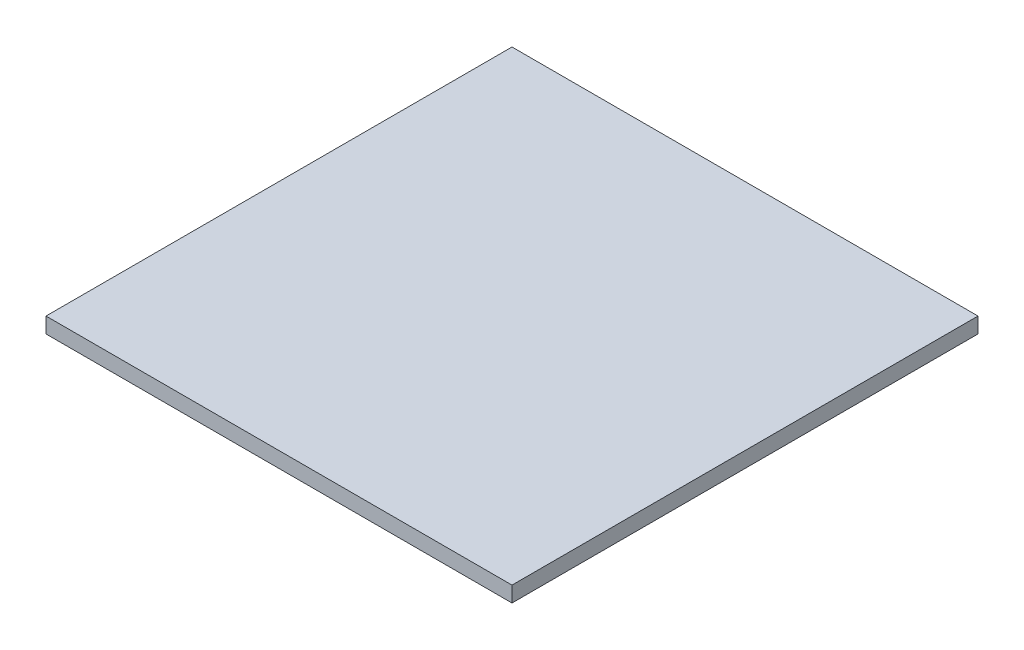
ISO-10303-21;
HEADER;
FILE_DESCRIPTION(('STEP AP214'),'2;1');
FILE_NAME('part.step','',(''),(''),'','','');
FILE_SCHEMA(('AUTOMOTIVE_DESIGN { 1 0 10303 214 1 1 1 1 }'));
ENDSEC;
DATA;
#1=APPLICATION_CONTEXT('core data for automotive mechanical design processes');
#2=APPLICATION_PROTOCOL_DEFINITION('international standard','automotive_design',2000,#1);
#3=PRODUCT_CONTEXT('',#1,'mechanical');
#4=PRODUCT('Part','Part','',(#3));
#5=PRODUCT_RELATED_PRODUCT_CATEGORY('part','',(#4));
#6=PRODUCT_DEFINITION_FORMATION('','',#4);
#7=PRODUCT_DEFINITION_CONTEXT('part definition',#1,'design');
#8=PRODUCT_DEFINITION('design','',#6,#7);
#9=PRODUCT_DEFINITION_SHAPE('','',#8);
#10=(LENGTH_UNIT() NAMED_UNIT(*) SI_UNIT(.MILLI.,.METRE.));
#11=(NAMED_UNIT(*) PLANE_ANGLE_UNIT() SI_UNIT($,.RADIAN.));
#12=(NAMED_UNIT(*) SI_UNIT($,.STERADIAN.) SOLID_ANGLE_UNIT());
#13=UNCERTAINTY_MEASURE_WITH_UNIT(LENGTH_MEASURE(1.E-05),#10,'distance_accuracy_value','');
#14=(GEOMETRIC_REPRESENTATION_CONTEXT(3) GLOBAL_UNCERTAINTY_ASSIGNED_CONTEXT((#13)) GLOBAL_UNIT_ASSIGNED_CONTEXT((#10,
#11,#12)) REPRESENTATION_CONTEXT('',''));
#15=CARTESIAN_POINT('',(0.,0.,0.));
#16=DIRECTION('',(0.,0.,1.));
#17=DIRECTION('',(1.,0.,0.));
#18=AXIS2_PLACEMENT_3D('',#15,#16,#17);
#19=CARTESIAN_POINT('',(150.,-5.,-150.));
#20=DIRECTION('',(1.,0.,0.));
#21=DIRECTION('',(0.,0.,-1.));
#22=AXIS2_PLACEMENT_3D('',#19,#20,#21);
#23=PLANE('',#22);
#24=DIRECTION('',(0.,0.,-1.));
#25=VECTOR('',#24,1.);
#26=CARTESIAN_POINT('',(150.,5.,-150.));
#27=LINE('',#26,#25);
#28=CARTESIAN_POINT('',(150.,5.,150.));
#29=VERTEX_POINT('',#28);
#30=CARTESIAN_POINT('',(150.,5.,-150.));
#31=VERTEX_POINT('',#30);
#32=EDGE_CURVE('E101',#29,#31,#27,.T.);
#33=ORIENTED_EDGE('',*,*,#32,.F.);
#34=DIRECTION('',(0.,1.,0.));
#35=VECTOR('',#34,1.);
#36=CARTESIAN_POINT('',(150.,-5.,150.));
#37=LINE('',#36,#35);
#38=CARTESIAN_POINT('',(150.,-5.,150.));
#39=VERTEX_POINT('',#38);
#40=EDGE_CURVE('E11',#39,#29,#37,.T.);
#41=ORIENTED_EDGE('',*,*,#40,.F.);
#42=DIRECTION('',(0.,0.,-1.));
#43=VECTOR('',#42,1.);
#44=CARTESIAN_POINT('',(150.,-5.,-150.));
#45=LINE('',#44,#43);
#46=CARTESIAN_POINT('',(150.,-5.,-150.));
#47=VERTEX_POINT('',#46);
#48=EDGE_CURVE('E95',#39,#47,#45,.T.);
#49=ORIENTED_EDGE('',*,*,#48,.T.);
#50=DIRECTION('',(0.,1.,0.));
#51=VECTOR('',#50,1.);
#52=CARTESIAN_POINT('',(150.,-5.,-150.));
#53=LINE('',#52,#51);
#54=EDGE_CURVE('E40',#47,#31,#53,.T.);
#55=ORIENTED_EDGE('',*,*,#54,.T.);
#56=EDGE_LOOP('',(#33,#41,#49,#55));
#57=FACE_BOUND('',#56,.T.);
#58=ADVANCED_FACE('F37',(#57),#23,.T.);
#59=CARTESIAN_POINT('',(-150.,-5.,150.));
#60=DIRECTION('',(0.,0.,1.));
#61=DIRECTION('',(1.,0.,0.));
#62=AXIS2_PLACEMENT_3D('',#59,#60,#61);
#63=PLANE('',#62);
#64=DIRECTION('',(1.,0.,0.));
#65=VECTOR('',#64,1.);
#66=CARTESIAN_POINT('',(-150.,5.,150.));
#67=LINE('',#66,#65);
#68=CARTESIAN_POINT('',(-150.,5.,150.));
#69=VERTEX_POINT('',#68);
#70=EDGE_CURVE('E97',#69,#29,#67,.T.);
#71=ORIENTED_EDGE('',*,*,#70,.F.);
#72=DIRECTION('',(0.,1.,0.));
#73=VECTOR('',#72,1.);
#74=CARTESIAN_POINT('',(-150.,-5.,150.));
#75=LINE('',#74,#73);
#76=CARTESIAN_POINT('',(-150.,-5.,150.));
#77=VERTEX_POINT('',#76);
#78=EDGE_CURVE('E46',#77,#69,#75,.T.);
#79=ORIENTED_EDGE('',*,*,#78,.F.);
#80=DIRECTION('',(1.,0.,0.));
#81=VECTOR('',#80,1.);
#82=CARTESIAN_POINT('',(-150.,-5.,150.));
#83=LINE('',#82,#81);
#84=EDGE_CURVE('E92',#77,#39,#83,.T.);
#85=ORIENTED_EDGE('',*,*,#84,.T.);
#86=ORIENTED_EDGE('',*,*,#40,.T.);
#87=EDGE_LOOP('',(#71,#79,#85,#86));
#88=FACE_BOUND('',#87,.T.);
#89=ADVANCED_FACE('F111',(#88),#63,.T.);
#90=CARTESIAN_POINT('',(-150.,-5.,-150.));
#91=DIRECTION('',(-1.,0.,0.));
#92=DIRECTION('',(0.,0.,1.));
#93=AXIS2_PLACEMENT_3D('',#90,#91,#92);
#94=PLANE('',#93);
#95=DIRECTION('',(0.,0.,1.));
#96=VECTOR('',#95,1.);
#97=CARTESIAN_POINT('',(-150.,5.,-150.));
#98=LINE('',#97,#96);
#99=CARTESIAN_POINT('',(-150.,5.,-150.));
#100=VERTEX_POINT('',#99);
#101=EDGE_CURVE('E87',#100,#69,#98,.T.);
#102=ORIENTED_EDGE('',*,*,#101,.F.);
#103=DIRECTION('',(0.,1.,0.));
#104=VECTOR('',#103,1.);
#105=CARTESIAN_POINT('',(-150.,-5.,-150.));
#106=LINE('',#105,#104);
#107=CARTESIAN_POINT('',(-150.,-5.,-150.));
#108=VERTEX_POINT('',#107);
#109=EDGE_CURVE('E82',#108,#100,#106,.T.);
#110=ORIENTED_EDGE('',*,*,#109,.F.);
#111=DIRECTION('',(0.,0.,1.));
#112=VECTOR('',#111,1.);
#113=CARTESIAN_POINT('',(-150.,-5.,-150.));
#114=LINE('',#113,#112);
#115=EDGE_CURVE('E85',#108,#77,#114,.T.);
#116=ORIENTED_EDGE('',*,*,#115,.T.);
#117=ORIENTED_EDGE('',*,*,#78,.T.);
#118=EDGE_LOOP('',(#102,#110,#116,#117));
#119=FACE_BOUND('',#118,.T.);
#120=ADVANCED_FACE('F84',(#119),#94,.T.);
#121=CARTESIAN_POINT('',(-150.,-5.,-150.));
#122=DIRECTION('',(0.,0.,-1.));
#123=DIRECTION('',(-1.,0.,0.));
#124=AXIS2_PLACEMENT_3D('',#121,#122,#123);
#125=PLANE('',#124);
#126=DIRECTION('',(-1.,0.,0.));
#127=VECTOR('',#126,1.);
#128=CARTESIAN_POINT('',(-150.,5.,-150.));
#129=LINE('',#128,#127);
#130=EDGE_CURVE('E104',#31,#100,#129,.T.);
#131=ORIENTED_EDGE('',*,*,#130,.F.);
#132=ORIENTED_EDGE('',*,*,#54,.F.);
#133=DIRECTION('',(-1.,0.,0.));
#134=VECTOR('',#133,1.);
#135=CARTESIAN_POINT('',(-150.,-5.,-150.));
#136=LINE('',#135,#134);
#137=EDGE_CURVE('E91',#47,#108,#136,.T.);
#138=ORIENTED_EDGE('',*,*,#137,.T.);
#139=ORIENTED_EDGE('',*,*,#109,.T.);
#140=EDGE_LOOP('',(#131,#132,#138,#139));
#141=FACE_BOUND('',#140,.T.);
#142=ADVANCED_FACE('F94',(#141),#125,.T.);
#143=CARTESIAN_POINT('',(0.,-5.,0.));
#144=DIRECTION('',(0.,1.,0.));
#145=DIRECTION('',(0.,0.,1.));
#146=AXIS2_PLACEMENT_3D('',#143,#144,#145);
#147=PLANE('',#146);
#148=ORIENTED_EDGE('',*,*,#48,.F.);
#149=ORIENTED_EDGE('',*,*,#84,.F.);
#150=ORIENTED_EDGE('',*,*,#115,.F.);
#151=ORIENTED_EDGE('',*,*,#137,.F.);
#152=EDGE_LOOP('',(#148,#149,#150,#151));
#153=FACE_BOUND('',#152,.T.);
#154=ADVANCED_FACE('F90',(#153),#147,.F.);
#155=CARTESIAN_POINT('',(0.,5.,0.));
#156=DIRECTION('',(0.,1.,0.));
#157=DIRECTION('',(0.,0.,1.));
#158=AXIS2_PLACEMENT_3D('',#155,#156,#157);
#159=PLANE('',#158);
#160=ORIENTED_EDGE('',*,*,#32,.T.);
#161=ORIENTED_EDGE('',*,*,#130,.T.);
#162=ORIENTED_EDGE('',*,*,#101,.T.);
#163=ORIENTED_EDGE('',*,*,#70,.T.);
#164=EDGE_LOOP('',(#160,#161,#162,#163));
#165=FACE_BOUND('',#164,.T.);
#166=ADVANCED_FACE('F110',(#165),#159,.T.);
#167=CLOSED_SHELL('',(#58,#89,#120,#142,#154,#166));
#168=MANIFOLD_SOLID_BREP('B2',#167);
#169=ADVANCED_BREP_SHAPE_REPRESENTATION('',(#18,#168),#14);
#170=SHAPE_DEFINITION_REPRESENTATION(#9,#169);
ENDSEC;
END-ISO-10303-21;
